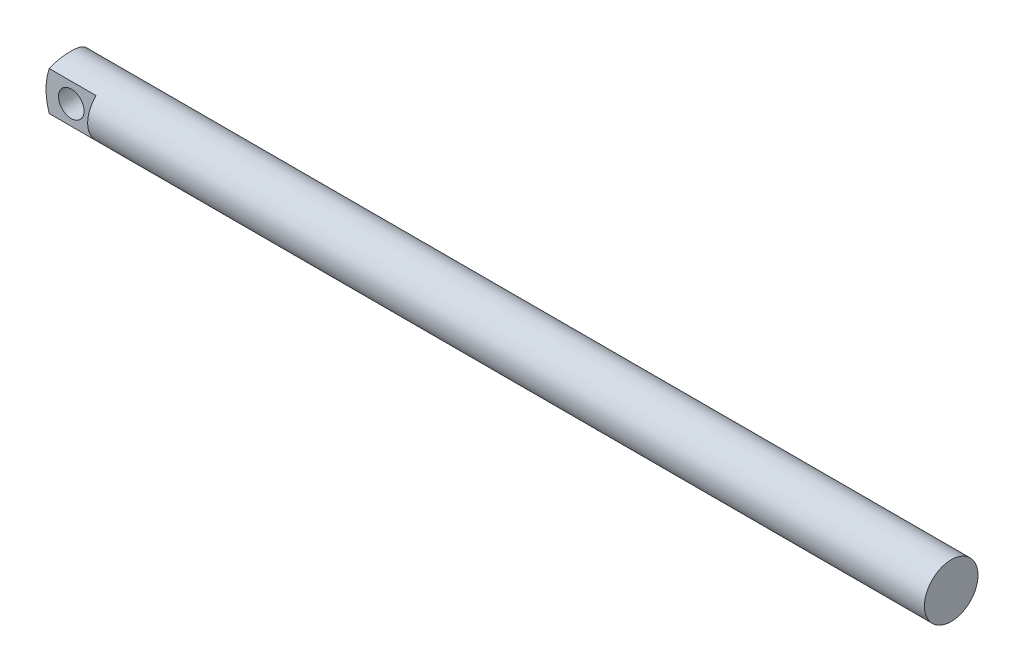
ISO-10303-21;
HEADER;
FILE_DESCRIPTION(('STEP AP214'),'2;1');
FILE_NAME('part.step','',(''),(''),'','','');
FILE_SCHEMA(('AUTOMOTIVE_DESIGN { 1 0 10303 214 1 1 1 1 }'));
ENDSEC;
DATA;
#1=APPLICATION_CONTEXT('core data for automotive mechanical design processes');
#2=APPLICATION_PROTOCOL_DEFINITION('international standard','automotive_design',2000,#1);
#3=PRODUCT_CONTEXT('',#1,'mechanical');
#4=PRODUCT('Part','Part','',(#3));
#5=PRODUCT_RELATED_PRODUCT_CATEGORY('part','',(#4));
#6=PRODUCT_DEFINITION_FORMATION('','',#4);
#7=PRODUCT_DEFINITION_CONTEXT('part definition',#1,'design');
#8=PRODUCT_DEFINITION('design','',#6,#7);
#9=PRODUCT_DEFINITION_SHAPE('','',#8);
#10=(LENGTH_UNIT() NAMED_UNIT(*) SI_UNIT(.MILLI.,.METRE.));
#11=(NAMED_UNIT(*) PLANE_ANGLE_UNIT() SI_UNIT($,.RADIAN.));
#12=(NAMED_UNIT(*) SI_UNIT($,.STERADIAN.) SOLID_ANGLE_UNIT());
#13=UNCERTAINTY_MEASURE_WITH_UNIT(LENGTH_MEASURE(1.E-05),#10,'distance_accuracy_value','');
#14=(GEOMETRIC_REPRESENTATION_CONTEXT(3) GLOBAL_UNCERTAINTY_ASSIGNED_CONTEXT((#13)) GLOBAL_UNIT_ASSIGNED_CONTEXT((#10,
#11,#12)) REPRESENTATION_CONTEXT('',''));
#15=CARTESIAN_POINT('',(0.,0.,0.));
#16=DIRECTION('',(0.,0.,1.));
#17=DIRECTION('',(1.,0.,0.));
#18=AXIS2_PLACEMENT_3D('',#15,#16,#17);
#19=CARTESIAN_POINT('',(139.,0.,4.5));
#20=DIRECTION('',(-1.,0.,0.));
#21=DIRECTION('',(0.,0.,1.));
#22=AXIS2_PLACEMENT_3D('',#19,#20,#21);
#23=PLANE('',#22);
#24=CARTESIAN_POINT('',(139.,4.45,-0.0499999999999986));
#25=DIRECTION('',(-1.,0.,0.));
#26=DIRECTION('',(0.,0.,1.));
#27=AXIS2_PLACEMENT_3D('',#24,#25,#26);
#28=CIRCLE('',#27,4.45);
#29=CARTESIAN_POINT('',(139.,4.45,4.4));
#30=VERTEX_POINT('',#29);
#31=EDGE_CURVE('E110',#30,#30,#28,.T.);
#32=ORIENTED_EDGE('',*,*,#31,.F.);
#33=EDGE_LOOP('',(#32));
#34=FACE_BOUND('',#33,.T.);
#35=ADVANCED_FACE('F53',(#34),#23,.F.);
#36=CARTESIAN_POINT('',(1.68,4.45,3.));
#37=DIRECTION('',(0.,0.,-1.));
#38=DIRECTION('',(-1.,0.,0.));
#39=AXIS2_PLACEMENT_3D('',#36,#37,#38);
#40=CYLINDRICAL_SURFACE('',#39,10.);
#41=CARTESIAN_POINT('',(1.68,4.45,3.));
#42=DIRECTION('',(0.,0.,1.));
#43=DIRECTION('',(1.,0.,0.));
#44=AXIS2_PLACEMENT_3D('',#41,#42,#43);
#45=CIRCLE('',#44,10.);
#46=CARTESIAN_POINT('',(-7.78044396421225,7.69037034920393,3.));
#47=VERTEX_POINT('',#46);
#48=CARTESIAN_POINT('',(-7.78044396421225,1.20962965079607,3.));
#49=VERTEX_POINT('',#48);
#50=EDGE_CURVE('E95',#47,#49,#45,.T.);
#51=ORIENTED_EDGE('',*,*,#50,.F.);
#52=CARTESIAN_POINT('',(-8.32,4.45,-4.5));
#53=CARTESIAN_POINT('',(-8.3200199640984,4.56897490340994,-4.50001885818006));
#54=CARTESIAN_POINT('',(-8.31787748197554,4.68794056131842,-4.49522949153052));
#55=CARTESIAN_POINT('',(-8.30941417962901,4.92492135344239,-4.47617557888353));
#56=CARTESIAN_POINT('',(-8.30309479401979,5.04293679993919,-4.46191428614009));
#57=CARTESIAN_POINT('',(-8.28645683031452,5.27670750993819,-4.42413204606782));
#58=CARTESIAN_POINT('',(-8.2761540759957,5.39246983629895,-4.40064773108425));
#59=CARTESIAN_POINT('',(-8.25182149683255,5.62139572581457,-4.34467310653524));
#60=CARTESIAN_POINT('',(-8.2377914861288,5.73455915906997,-4.31218234786046));
#61=CARTESIAN_POINT('',(-8.20637232554824,5.95741070900459,-4.23855160147602));
#62=CARTESIAN_POINT('',(-8.18898706683174,6.06710268173478,-4.1974216280321));
#63=CARTESIAN_POINT('',(-8.15127356922842,6.28249597467659,-4.10686195580153));
#64=CARTESIAN_POINT('',(-8.13094423076485,6.38819578518663,-4.05742915490597));
#65=CARTESIAN_POINT('',(-8.06622503744121,6.69846839408893,-3.89720687549396));
#66=CARTESIAN_POINT('',(-8.01809793774345,6.89625550451192,-3.77447981058112));
#67=CARTESIAN_POINT('',(-7.91373231064322,7.27872243645429,-3.49383624275712));
#68=CARTESIAN_POINT('',(-7.85720748236438,7.46224191653808,-3.33445978872982));
#69=CARTESIAN_POINT('',(-7.74349278884187,7.80107838204387,-2.98793160747146));
#70=CARTESIAN_POINT('',(-7.68630253297768,7.95637781014459,-2.80076271964251));
#71=CARTESIAN_POINT('',(-7.60291703847469,8.16937522036404,-2.49649280068614));
#72=CARTESIAN_POINT('',(-7.57479243055035,8.23862969258201,-2.38782855465632));
#73=CARTESIAN_POINT('',(-7.52091129134574,8.36766644355445,-2.16447420660086));
#74=CARTESIAN_POINT('',(-7.49515381252892,8.42745251939974,-2.04978654482911));
#75=CARTESIAN_POINT('',(-7.44689556865651,8.5369748276353,-1.81518511252517));
#76=CARTESIAN_POINT('',(-7.42439166333262,8.58672076913157,-1.69527652855863));
#77=CARTESIAN_POINT('',(-7.3834318444259,8.67570645015909,-1.45100169228141));
#78=CARTESIAN_POINT('',(-7.36497479395914,8.71494914105657,-1.32663670336143));
#79=CARTESIAN_POINT('',(-7.32515461457148,8.79859737048523,-1.01404936354558));
#80=CARTESIAN_POINT('',(-7.30660892992874,8.83652767194839,-0.823679085393477));
#81=CARTESIAN_POINT('',(-7.28169017127776,8.88722206139813,-0.43883571433454));
#82=CARTESIAN_POINT('',(-7.27531387747449,8.89999280616547,-0.24436372043719));
#83=CARTESIAN_POINT('',(-7.27530071793538,8.90000436854381,0.0680297411721867));
#84=CARTESIAN_POINT('',(-7.27764409582958,8.89530195580062,0.186019554623722));
#85=CARTESIAN_POINT('',(-7.2869208038721,8.87656217547235,0.421106200245627));
#86=CARTESIAN_POINT('',(-7.29385474511941,8.862523565045,0.538202911426041));
#87=CARTESIAN_POINT('',(-7.31208060153655,8.825261543653,0.770638061376163));
#88=CARTESIAN_POINT('',(-7.32337467917499,8.80203357496005,0.885975598106619));
#89=CARTESIAN_POINT('',(-7.34992965216958,8.74666198506053,1.11403990818543));
#90=CARTESIAN_POINT('',(-7.3651921471921,8.71451476815972,1.22676560870146));
#91=CARTESIAN_POINT('',(-7.41607691922172,8.60546201364398,1.55894121924645));
#92=CARTESIAN_POINT('',(-7.45689475624296,8.5157567761133,1.77354375368868));
#93=CARTESIAN_POINT('',(-7.5477008956995,8.30520443466056,2.18458063660902));
#94=CARTESIAN_POINT('',(-7.59769174689866,8.18434867163656,2.38100991269022));
#95=CARTESIAN_POINT('',(-7.70516298715657,7.90577923089276,2.76420490181986));
#96=CARTESIAN_POINT('',(-7.76291842125585,7.74619214380822,2.94953198861361));
#97=CARTESIAN_POINT('',(-7.87718904156571,7.39847889020212,3.29192554411119));
#98=CARTESIAN_POINT('',(-7.93370376466061,7.21034226766194,3.44898161253883));
#99=CARTESIAN_POINT('',(-8.01463997393055,6.90476924594876,3.66392394782786));
#100=CARTESIAN_POINT('',(-8.04158014119729,6.79607073333245,3.73353920193608));
#101=CARTESIAN_POINT('',(-8.09280766749465,6.5725805154069,3.86328845829878));
#102=CARTESIAN_POINT('',(-8.1170960808427,6.45779125890547,3.92342623297649));
#103=CARTESIAN_POINT('',(-8.16230204683087,6.22295485874424,4.03361781647414));
#104=CARTESIAN_POINT('',(-8.18322261549871,6.10291254332665,4.08368065792852));
#105=CARTESIAN_POINT('',(-8.22109783873207,5.85840040576381,4.17325436757755));
#106=CARTESIAN_POINT('',(-8.23805327134217,5.73393145775025,4.21276730610501));
#107=CARTESIAN_POINT('',(-8.27461500180557,5.42012340127409,4.29729661079109));
#108=CARTESIAN_POINT('',(-8.29151880432929,5.22859975792476,4.33568812871449));
#109=CARTESIAN_POINT('',(-8.30854297870284,4.93834950728564,4.37420638921176));
#110=CARTESIAN_POINT('',(-8.31282921317766,4.84101298566291,4.3838677250132));
#111=CARTESIAN_POINT('',(-8.31856024209678,4.64579844260808,4.39676583024589));
#112=CARTESIAN_POINT('',(-8.32000405408721,4.54792024566941,4.40000037832814));
#113=CARTESIAN_POINT('',(-8.32,4.45,4.4));
#114=B_SPLINE_CURVE_WITH_KNOTS('',3,(#52,#53,#54,#55,#56,#57,#58,#59,#60,#61,#62,#63,#64,#65,
#66,#67,#68,#69,#70,#71,#72,#73,#74,#75,#76,#77,#78,#79,#80,#81,#82,#83,#84,#85,#86,#87,#88,#89,
#90,#91,#92,#93,#94,#95,#96,#97,#98,#99,#100,#101,#102,#103,#104,#105,#106,#107,#108,#109,#110,
#111,#112,#113),.UNSPECIFIED.,.F.,.F.,(4,2,2,2,2,2,2,2,2,2,2,2,2,2,2,2,2,2,2,2,2,2,2,2,2,2,2,2,
2,2,4),(0.,0.35679458717717,0.713466692024366,1.06873625197898,1.42402353075715,
1.77890122393545,2.13391180294098,2.84380314051398,3.58941546704336,4.33549010546527,
4.73074714859388,5.12584527904636,5.52055948774576,5.91516266680415,6.49810235887818,
7.08088779453222,7.43479136241228,7.78874205165826,8.14286851352847,8.49713794544073,
9.20220066615698,9.90745958923489,10.6581700548496,11.4091561281703,11.8043143072296,
12.1993147977774,12.5939595591453,12.9885268176649,13.5744541438637,13.8679666330074,
14.1615805539024),.UNSPECIFIED.);
#115=CARTESIAN_POINT('',(-7.74867965305854,7.78166624979154,-3.));
#116=VERTEX_POINT('',#115);
#117=EDGE_CURVE('E12',#116,#47,#114,.T.);
#118=ORIENTED_EDGE('',*,*,#117,.F.);
#119=CARTESIAN_POINT('',(1.68,4.45,-3.));
#120=DIRECTION('',(0.,0.,1.));
#121=DIRECTION('',(1.,0.,0.));
#122=AXIS2_PLACEMENT_3D('',#119,#120,#121);
#123=CIRCLE('',#122,10.);
#124=CARTESIAN_POINT('',(-7.74867965305853,1.11833375020846,-3.));
#125=VERTEX_POINT('',#124);
#126=EDGE_CURVE('E107',#116,#125,#123,.T.);
#127=ORIENTED_EDGE('',*,*,#126,.T.);
#128=CARTESIAN_POINT('',(-8.32,4.45,4.4));
#129=CARTESIAN_POINT('',(-8.3200199640984,4.33102509659006,4.40001885818006));
#130=CARTESIAN_POINT('',(-8.31787748197554,4.21205943868158,4.39522949153052));
#131=CARTESIAN_POINT('',(-8.30941417962901,3.97507864655761,4.37617557888353));
#132=CARTESIAN_POINT('',(-8.30309479401979,3.85706320006081,4.36191428614009));
#133=CARTESIAN_POINT('',(-8.28645683031452,3.62329249006181,4.32413204606782));
#134=CARTESIAN_POINT('',(-8.2761540759957,3.50753016370105,4.30064773108426));
#135=CARTESIAN_POINT('',(-8.25182149683255,3.27860427418543,4.24467310653525));
#136=CARTESIAN_POINT('',(-8.2377914861288,3.16544084093003,4.21218234786046));
#137=CARTESIAN_POINT('',(-8.20637232554824,2.94258929099541,4.13855160147602));
#138=CARTESIAN_POINT('',(-8.18898706683174,2.83289731826522,4.09742162803211));
#139=CARTESIAN_POINT('',(-8.15127356922842,2.61750402532341,4.00686195580153));
#140=CARTESIAN_POINT('',(-8.13094423076485,2.51180421481337,3.95742915490598));
#141=CARTESIAN_POINT('',(-8.06622503744121,2.20153160591107,3.79720687549396));
#142=CARTESIAN_POINT('',(-8.01809793774345,2.00374449548808,3.67447981058112));
#143=CARTESIAN_POINT('',(-7.91373231064322,1.62127756354571,3.39383624275713));
#144=CARTESIAN_POINT('',(-7.85720748236438,1.43775808346192,3.23445978872982));
#145=CARTESIAN_POINT('',(-7.74349278884186,1.09892161795613,2.88793160747147));
#146=CARTESIAN_POINT('',(-7.68630253297768,0.94362218985541,2.70076271964252));
#147=CARTESIAN_POINT('',(-7.60291703847469,0.730624779635963,2.39649280068614));
#148=CARTESIAN_POINT('',(-7.57479243055035,0.661370307417985,2.28782855465632));
#149=CARTESIAN_POINT('',(-7.52091129134574,0.532333556445552,2.06447420660087));
#150=CARTESIAN_POINT('',(-7.49515381252892,0.472547480600259,1.94978654482912));
#151=CARTESIAN_POINT('',(-7.44689556865651,0.363025172364703,1.71518511252518));
#152=CARTESIAN_POINT('',(-7.42439166333262,0.313279230868431,1.59527652855864));
#153=CARTESIAN_POINT('',(-7.3834318444259,0.224293549840905,1.35100169228142));
#154=CARTESIAN_POINT('',(-7.36497479395914,0.185050858943425,1.22663670336144));
#155=CARTESIAN_POINT('',(-7.32515461457147,0.101402629514766,0.914049363545586));
#156=CARTESIAN_POINT('',(-7.30660892992874,0.0634723280516142,0.72367908539348));
#157=CARTESIAN_POINT('',(-7.28169017127776,0.0127779386018674,0.338835714334542));
#158=CARTESIAN_POINT('',(-7.27531387747449,7.19383452897314E-06,0.144363720437193));
#159=CARTESIAN_POINT('',(-7.27530071793537,-4.36854381117147E-06,-0.168029741172184));
#160=CARTESIAN_POINT('',(-7.27764409582958,0.00469804419938332,-0.28601955462372));
#161=CARTESIAN_POINT('',(-7.28692080387209,0.0234378245276444,-0.521106200245624));
#162=CARTESIAN_POINT('',(-7.29385474511941,0.0374764349549976,-0.638202911426038));
#163=CARTESIAN_POINT('',(-7.31208060153655,0.0747384563469953,-0.870638061376161));
#164=CARTESIAN_POINT('',(-7.32337467917499,0.0979664250399496,-0.985975598106616));
#165=CARTESIAN_POINT('',(-7.34992965216958,0.153338014939469,-1.21403990818543));
#166=CARTESIAN_POINT('',(-7.3651921471921,0.185485231840276,-1.32676560870146));
#167=CARTESIAN_POINT('',(-7.41607691922172,0.294537986356017,-1.65894121924645));
#168=CARTESIAN_POINT('',(-7.45689475624296,0.384243223886694,-1.87354375368867));
#169=CARTESIAN_POINT('',(-7.5477008956995,0.594795565339441,-2.28458063660901));
#170=CARTESIAN_POINT('',(-7.59769174689867,0.715651328363437,-2.48100991269021));
#171=CARTESIAN_POINT('',(-7.70516298715657,0.994220769107238,-2.86420490181986));
#172=CARTESIAN_POINT('',(-7.76291842125585,1.15380785619178,-3.04953198861361));
#173=CARTESIAN_POINT('',(-7.87718904156571,1.50152110979787,-3.39192554411119));
#174=CARTESIAN_POINT('',(-7.93370376466061,1.68965773233806,-3.54898161253882));
#175=CARTESIAN_POINT('',(-8.01463997393055,1.99523075405124,-3.76392394782786));
#176=CARTESIAN_POINT('',(-8.04158014119729,2.10392926666754,-3.83353920193607));
#177=CARTESIAN_POINT('',(-8.09280766749465,2.32741948459309,-3.96328845829877));
#178=CARTESIAN_POINT('',(-8.1170960808427,2.44220874109453,-4.02342623297649));
#179=CARTESIAN_POINT('',(-8.16230204683087,2.67704514125575,-4.13361781647414));
#180=CARTESIAN_POINT('',(-8.18322261549871,2.79708745667335,-4.18368065792851));
#181=CARTESIAN_POINT('',(-8.22109783873207,3.04159959423618,-4.27325436757754));
#182=CARTESIAN_POINT('',(-8.23805327134217,3.16606854224975,-4.31276730610501));
#183=CARTESIAN_POINT('',(-8.27461500180557,3.47987659872591,-4.39729661079109));
#184=CARTESIAN_POINT('',(-8.29151880432929,3.67140024207524,-4.43568812871448));
#185=CARTESIAN_POINT('',(-8.30854297870284,3.96165049271436,-4.47420638921176));
#186=CARTESIAN_POINT('',(-8.31282921317766,4.05898701433708,-4.4838677250132));
#187=CARTESIAN_POINT('',(-8.31856024209678,4.25420155739192,-4.49676583024589));
#188=CARTESIAN_POINT('',(-8.32000405408721,4.35207975433059,-4.50000037832814));
#189=CARTESIAN_POINT('',(-8.32,4.45,-4.5));
#190=B_SPLINE_CURVE_WITH_KNOTS('',3,(#128,#129,#130,#131,#132,#133,#134,#135,#136,#137,#138,
#139,#140,#141,#142,#143,#144,#145,#146,#147,#148,#149,#150,#151,#152,#153,#154,#155,#156,#157,
#158,#159,#160,#161,#162,#163,#164,#165,#166,#167,#168,#169,#170,#171,#172,#173,#174,#175,#176,
#177,#178,#179,#180,#181,#182,#183,#184,#185,#186,#187,#188,#189),.UNSPECIFIED.,.F.,.F.,(4,2,2,
2,2,2,2,2,2,2,2,2,2,2,2,2,2,2,2,2,2,2,2,2,2,2,2,2,2,2,4),(0.,0.35679458717717,0.713466692024366,
1.06873625197898,1.42402353075715,1.77890122393545,2.13391180294098,2.84380314051398,
3.58941546704336,4.33549010546527,4.73074714859388,5.12584527904636,5.52055948774576,
5.91516266680415,6.49810235887818,7.08088779453222,7.43479136241228,7.78874205165826,
8.14286851352847,8.49713794544073,9.20220066615698,9.90745958923489,10.6581700548496,
11.4091561281703,11.8043143072296,12.1993147977774,12.5939595591453,12.9885268176649,
13.5744541438637,13.8679666330074,14.1615805539024),.UNSPECIFIED.);
#191=EDGE_CURVE('E105',#49,#125,#190,.T.);
#192=ORIENTED_EDGE('',*,*,#191,.F.);
#193=EDGE_LOOP('',(#51,#118,#127,#192));
#194=FACE_BOUND('',#193,.T.);
#195=ADVANCED_FACE('F55',(#194),#40,.T.);
#196=CARTESIAN_POINT('',(0.,0.,4.5));
#197=DIRECTION('',(-1.,0.,0.));
#198=DIRECTION('',(0.,0.,1.));
#199=AXIS2_PLACEMENT_3D('',#196,#197,#198);
#200=PLANE('',#199);
#201=CARTESIAN_POINT('',(0.,4.45,-0.0499999999999986));
#202=DIRECTION('',(-1.,0.,0.));
#203=DIRECTION('',(0.,0.,1.));
#204=AXIS2_PLACEMENT_3D('',#201,#202,#203);
#205=CIRCLE('',#204,4.45);
#206=CARTESIAN_POINT('',(0.,1.20962965079607,3.));
#207=VERTEX_POINT('',#206);
#208=CARTESIAN_POINT('',(0.,7.69037034920393,3.));
#209=VERTEX_POINT('',#208);
#210=EDGE_CURVE('E70',#207,#209,#205,.T.);
#211=ORIENTED_EDGE('',*,*,#210,.T.);
#212=DIRECTION('',(0.,1.,0.));
#213=VECTOR('',#212,1.);
#214=CARTESIAN_POINT('',(0.,0.,3.));
#215=LINE('',#214,#213);
#216=EDGE_CURVE('E117',#207,#209,#215,.T.);
#217=ORIENTED_EDGE('',*,*,#216,.F.);
#218=EDGE_LOOP('',(#211,#217));
#219=FACE_BOUND('',#218,.T.);
#220=ADVANCED_FACE('F139',(#219),#200,.T.);
#221=CARTESIAN_POINT('',(0.,0.,3.));
#222=DIRECTION('',(0.,0.,1.));
#223=DIRECTION('',(1.,0.,0.));
#224=AXIS2_PLACEMENT_3D('',#221,#222,#223);
#225=PLANE('',#224);
#226=CARTESIAN_POINT('',(-4.125,4.45,3.));
#227=DIRECTION('',(0.,0.,1.));
#228=DIRECTION('',(1.,0.,0.));
#229=AXIS2_PLACEMENT_3D('',#226,#227,#228);
#230=CIRCLE('',#229,2.125);
#231=CARTESIAN_POINT('',(-2.,4.45,3.));
#232=VERTEX_POINT('',#231);
#233=EDGE_CURVE('E170',#232,#232,#230,.T.);
#234=ORIENTED_EDGE('',*,*,#233,.F.);
#235=EDGE_LOOP('',(#234));
#236=FACE_BOUND('',#235,.T.);
#237=ORIENTED_EDGE('',*,*,#216,.T.);
#238=DIRECTION('',(1.,0.,0.));
#239=VECTOR('',#238,1.);
#240=CARTESIAN_POINT('',(-61.,7.69037034920393,3.));
#241=LINE('',#240,#239);
#242=EDGE_CURVE('E101',#209,#47,#241,.F.);
#243=ORIENTED_EDGE('',*,*,#242,.T.);
#244=ORIENTED_EDGE('',*,*,#50,.T.);
#245=DIRECTION('',(1.,0.,0.));
#246=VECTOR('',#245,1.);
#247=CARTESIAN_POINT('',(-61.,1.20962965079607,3.));
#248=LINE('',#247,#246);
#249=EDGE_CURVE('E100',#49,#207,#248,.T.);
#250=ORIENTED_EDGE('',*,*,#249,.T.);
#251=EDGE_LOOP('',(#237,#243,#244,#250));
#252=FACE_BOUND('',#251,.T.);
#253=ADVANCED_FACE('F98',(#236,#252),#225,.T.);
#254=DIRECTION('',(0.,1.,0.));
#255=VECTOR('',#254,1.);
#256=CARTESIAN_POINT('',(0.,0.,-3.));
#257=LINE('',#256,#255);
#258=CARTESIAN_POINT('',(0.,1.11833375020846,-3.));
#259=VERTEX_POINT('',#258);
#260=CARTESIAN_POINT('',(0.,7.78166624979154,-3.));
#261=VERTEX_POINT('',#260);
#262=EDGE_CURVE('E58',#259,#261,#257,.T.);
#263=ORIENTED_EDGE('',*,*,#262,.T.);
#264=CARTESIAN_POINT('',(0.,4.45,-0.0499999999999986));
#265=DIRECTION('',(-1.,0.,0.));
#266=DIRECTION('',(0.,0.,1.));
#267=AXIS2_PLACEMENT_3D('',#264,#265,#266);
#268=CIRCLE('',#267,4.45);
#269=EDGE_CURVE('E115',#261,#259,#268,.T.);
#270=ORIENTED_EDGE('',*,*,#269,.T.);
#271=EDGE_LOOP('',(#263,#270));
#272=FACE_BOUND('',#271,.T.);
#273=ADVANCED_FACE('F141',(#272),#200,.T.);
#274=CARTESIAN_POINT('',(0.,0.,-3.));
#275=DIRECTION('',(0.,0.,1.));
#276=DIRECTION('',(1.,0.,0.));
#277=AXIS2_PLACEMENT_3D('',#274,#275,#276);
#278=PLANE('',#277);
#279=CARTESIAN_POINT('',(-4.125,4.45,-3.));
#280=DIRECTION('',(0.,0.,1.));
#281=DIRECTION('',(1.,0.,0.));
#282=AXIS2_PLACEMENT_3D('',#279,#280,#281);
#283=CIRCLE('',#282,2.125);
#284=CARTESIAN_POINT('',(-2.,4.45,-3.));
#285=VERTEX_POINT('',#284);
#286=EDGE_CURVE('E166',#285,#285,#283,.T.);
#287=ORIENTED_EDGE('',*,*,#286,.T.);
#288=EDGE_LOOP('',(#287));
#289=FACE_BOUND('',#288,.T.);
#290=DIRECTION('',(1.,0.,0.));
#291=VECTOR('',#290,1.);
#292=CARTESIAN_POINT('',(-61.,7.78166624979154,-3.));
#293=LINE('',#292,#291);
#294=EDGE_CURVE('E63',#261,#116,#293,.F.);
#295=ORIENTED_EDGE('',*,*,#294,.F.);
#296=ORIENTED_EDGE('',*,*,#262,.F.);
#297=DIRECTION('',(1.,0.,0.));
#298=VECTOR('',#297,1.);
#299=CARTESIAN_POINT('',(-61.,1.11833375020846,-3.));
#300=LINE('',#299,#298);
#301=EDGE_CURVE('E109',#125,#259,#300,.T.);
#302=ORIENTED_EDGE('',*,*,#301,.F.);
#303=ORIENTED_EDGE('',*,*,#126,.F.);
#304=EDGE_LOOP('',(#295,#296,#302,#303));
#305=FACE_BOUND('',#304,.T.);
#306=ADVANCED_FACE('F149',(#289,#305),#278,.F.);
#307=CARTESIAN_POINT('',(-4.125,4.45,3.));
#308=DIRECTION('',(0.,0.,-1.));
#309=DIRECTION('',(-1.,0.,0.));
#310=AXIS2_PLACEMENT_3D('',#307,#308,#309);
#311=CYLINDRICAL_SURFACE('',#310,2.125);
#312=ORIENTED_EDGE('',*,*,#233,.T.);
#313=EDGE_LOOP('',(#312));
#314=FACE_BOUND('',#313,.T.);
#315=ORIENTED_EDGE('',*,*,#286,.F.);
#316=EDGE_LOOP('',(#315));
#317=FACE_BOUND('',#316,.T.);
#318=ADVANCED_FACE('F127',(#314,#317),#311,.F.);
#319=CARTESIAN_POINT('',(-61.,4.45,-0.0499999999999986));
#320=DIRECTION('',(1.,0.,0.));
#321=DIRECTION('',(0.,0.,-1.));
#322=AXIS2_PLACEMENT_3D('',#319,#320,#321);
#323=CYLINDRICAL_SURFACE('',#322,4.45);
#324=ORIENTED_EDGE('',*,*,#31,.T.);
#325=EDGE_LOOP('',(#324));
#326=FACE_BOUND('',#325,.T.);
#327=ORIENTED_EDGE('',*,*,#242,.F.);
#328=ORIENTED_EDGE('',*,*,#210,.F.);
#329=ORIENTED_EDGE('',*,*,#249,.F.);
#330=ORIENTED_EDGE('',*,*,#191,.T.);
#331=ORIENTED_EDGE('',*,*,#301,.T.);
#332=ORIENTED_EDGE('',*,*,#269,.F.);
#333=ORIENTED_EDGE('',*,*,#294,.T.);
#334=ORIENTED_EDGE('',*,*,#117,.T.);
#335=EDGE_LOOP('',(#327,#328,#329,#330,#331,#332,#333,#334));
#336=FACE_BOUND('',#335,.T.);
#337=ADVANCED_FACE('F112',(#326,#336),#323,.T.);
#338=CLOSED_SHELL('',(#35,#195,#220,#253,#273,#306,#318,#337));
#339=MANIFOLD_SOLID_BREP('B2',#338);
#340=ADVANCED_BREP_SHAPE_REPRESENTATION('',(#18,#339),#14);
#341=SHAPE_DEFINITION_REPRESENTATION(#9,#340);
ENDSEC;
END-ISO-10303-21;
